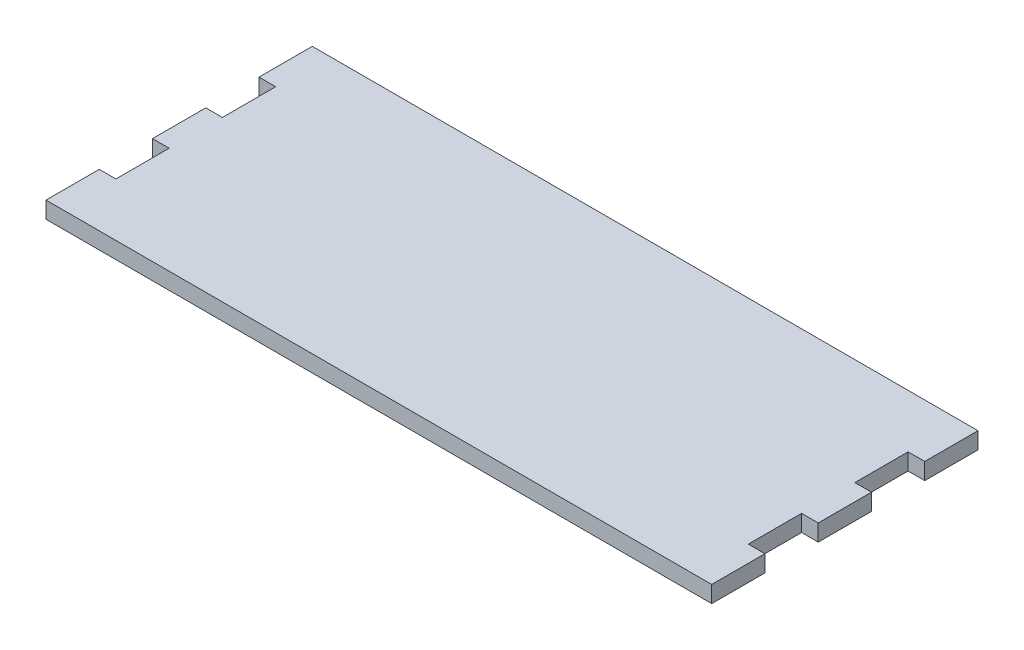
ISO-10303-21;
HEADER;
FILE_DESCRIPTION(('STEP AP214'),'2;1');
FILE_NAME('part.step','',(''),(''),'','','');
FILE_SCHEMA(('AUTOMOTIVE_DESIGN { 1 0 10303 214 1 1 1 1 }'));
ENDSEC;
DATA;
#1=APPLICATION_CONTEXT('core data for automotive mechanical design processes');
#2=APPLICATION_PROTOCOL_DEFINITION('international standard','automotive_design',2000,#1);
#3=PRODUCT_CONTEXT('',#1,'mechanical');
#4=PRODUCT('Part','Part','',(#3));
#5=PRODUCT_RELATED_PRODUCT_CATEGORY('part','',(#4));
#6=PRODUCT_DEFINITION_FORMATION('','',#4);
#7=PRODUCT_DEFINITION_CONTEXT('part definition',#1,'design');
#8=PRODUCT_DEFINITION('design','',#6,#7);
#9=PRODUCT_DEFINITION_SHAPE('','',#8);
#10=(LENGTH_UNIT() NAMED_UNIT(*) SI_UNIT(.MILLI.,.METRE.));
#11=(NAMED_UNIT(*) PLANE_ANGLE_UNIT() SI_UNIT($,.RADIAN.));
#12=(NAMED_UNIT(*) SI_UNIT($,.STERADIAN.) SOLID_ANGLE_UNIT());
#13=UNCERTAINTY_MEASURE_WITH_UNIT(LENGTH_MEASURE(1.E-05),#10,'distance_accuracy_value','');
#14=(GEOMETRIC_REPRESENTATION_CONTEXT(3) GLOBAL_UNCERTAINTY_ASSIGNED_CONTEXT((#13)) GLOBAL_UNIT_ASSIGNED_CONTEXT((#10,
#11,#12)) REPRESENTATION_CONTEXT('',''));
#15=CARTESIAN_POINT('',(0.,0.,0.));
#16=DIRECTION('',(0.,0.,1.));
#17=DIRECTION('',(1.,0.,0.));
#18=AXIS2_PLACEMENT_3D('',#15,#16,#17);
#19=CARTESIAN_POINT('',(100.,5.,24.));
#20=DIRECTION('',(-1.,0.,0.));
#21=DIRECTION('',(0.,0.,1.));
#22=AXIS2_PLACEMENT_3D('',#19,#20,#21);
#23=PLANE('',#22);
#24=DIRECTION('',(0.,0.,-1.));
#25=VECTOR('',#24,1.);
#26=CARTESIAN_POINT('',(100.,0.,24.));
#27=LINE('',#26,#25);
#28=CARTESIAN_POINT('',(100.,0.,40.));
#29=VERTEX_POINT('',#28);
#30=CARTESIAN_POINT('',(100.,0.,24.));
#31=VERTEX_POINT('',#30);
#32=EDGE_CURVE('E201',#29,#31,#27,.T.);
#33=ORIENTED_EDGE('',*,*,#32,.T.);
#34=DIRECTION('',(0.,-1.,0.));
#35=VECTOR('',#34,1.);
#36=CARTESIAN_POINT('',(100.,5.,24.));
#37=LINE('',#36,#35);
#38=CARTESIAN_POINT('',(100.,5.,24.));
#39=VERTEX_POINT('',#38);
#40=EDGE_CURVE('E11',#39,#31,#37,.T.);
#41=ORIENTED_EDGE('',*,*,#40,.F.);
#42=DIRECTION('',(0.,0.,-1.));
#43=VECTOR('',#42,1.);
#44=CARTESIAN_POINT('',(100.,5.,24.));
#45=LINE('',#44,#43);
#46=CARTESIAN_POINT('',(100.,5.,40.));
#47=VERTEX_POINT('',#46);
#48=EDGE_CURVE('E239',#47,#39,#45,.T.);
#49=ORIENTED_EDGE('',*,*,#48,.F.);
#50=DIRECTION('',(0.,-1.,0.));
#51=VECTOR('',#50,1.);
#52=CARTESIAN_POINT('',(100.,5.,40.));
#53=LINE('',#52,#51);
#54=EDGE_CURVE('E197',#47,#29,#53,.T.);
#55=ORIENTED_EDGE('',*,*,#54,.T.);
#56=EDGE_LOOP('',(#33,#41,#49,#55));
#57=FACE_BOUND('',#56,.T.);
#58=ADVANCED_FACE('F33',(#57),#23,.F.);
#59=CARTESIAN_POINT('',(95.,5.,24.));
#60=DIRECTION('',(0.,0.,1.));
#61=DIRECTION('',(1.,0.,0.));
#62=AXIS2_PLACEMENT_3D('',#59,#60,#61);
#63=PLANE('',#62);
#64=DIRECTION('',(-1.,0.,0.));
#65=VECTOR('',#64,1.);
#66=CARTESIAN_POINT('',(95.,0.,24.));
#67=LINE('',#66,#65);
#68=CARTESIAN_POINT('',(95.,0.,24.));
#69=VERTEX_POINT('',#68);
#70=EDGE_CURVE('E204',#31,#69,#67,.T.);
#71=ORIENTED_EDGE('',*,*,#70,.T.);
#72=DIRECTION('',(0.,-1.,0.));
#73=VECTOR('',#72,1.);
#74=CARTESIAN_POINT('',(95.,5.,24.));
#75=LINE('',#74,#73);
#76=CARTESIAN_POINT('',(95.,5.,24.));
#77=VERTEX_POINT('',#76);
#78=EDGE_CURVE('E41',#77,#69,#75,.T.);
#79=ORIENTED_EDGE('',*,*,#78,.F.);
#80=DIRECTION('',(-1.,0.,0.));
#81=VECTOR('',#80,1.);
#82=CARTESIAN_POINT('',(95.,5.,24.));
#83=LINE('',#82,#81);
#84=EDGE_CURVE('E128',#39,#77,#83,.T.);
#85=ORIENTED_EDGE('',*,*,#84,.F.);
#86=ORIENTED_EDGE('',*,*,#40,.T.);
#87=EDGE_LOOP('',(#71,#79,#85,#86));
#88=FACE_BOUND('',#87,.T.);
#89=ADVANCED_FACE('F357',(#88),#63,.F.);
#90=CARTESIAN_POINT('',(95.,5.,7.99999999999999));
#91=DIRECTION('',(-1.,0.,0.));
#92=DIRECTION('',(0.,0.,1.));
#93=AXIS2_PLACEMENT_3D('',#90,#91,#92);
#94=PLANE('',#93);
#95=DIRECTION('',(0.,0.,-1.));
#96=VECTOR('',#95,1.);
#97=CARTESIAN_POINT('',(95.,0.,7.99999999999999));
#98=LINE('',#97,#96);
#99=CARTESIAN_POINT('',(95.,0.,7.99999999999999));
#100=VERTEX_POINT('',#99);
#101=EDGE_CURVE('E206',#69,#100,#98,.T.);
#102=ORIENTED_EDGE('',*,*,#101,.T.);
#103=DIRECTION('',(0.,-1.,0.));
#104=VECTOR('',#103,1.);
#105=CARTESIAN_POINT('',(95.,5.,7.99999999999999));
#106=LINE('',#105,#104);
#107=CARTESIAN_POINT('',(95.,5.,7.99999999999999));
#108=VERTEX_POINT('',#107);
#109=EDGE_CURVE('E282',#108,#100,#106,.T.);
#110=ORIENTED_EDGE('',*,*,#109,.F.);
#111=DIRECTION('',(0.,0.,-1.));
#112=VECTOR('',#111,1.);
#113=CARTESIAN_POINT('',(95.,5.,7.99999999999999));
#114=LINE('',#113,#112);
#115=EDGE_CURVE('E290',#77,#108,#114,.T.);
#116=ORIENTED_EDGE('',*,*,#115,.F.);
#117=ORIENTED_EDGE('',*,*,#78,.T.);
#118=EDGE_LOOP('',(#102,#110,#116,#117));
#119=FACE_BOUND('',#118,.T.);
#120=ADVANCED_FACE('F288',(#119),#94,.F.);
#121=CARTESIAN_POINT('',(95.,5.,7.99999999999999));
#122=DIRECTION('',(0.,0.,-1.));
#123=DIRECTION('',(-1.,0.,0.));
#124=AXIS2_PLACEMENT_3D('',#121,#122,#123);
#125=PLANE('',#124);
#126=DIRECTION('',(1.,0.,0.));
#127=VECTOR('',#126,1.);
#128=CARTESIAN_POINT('',(95.,0.,7.99999999999999));
#129=LINE('',#128,#127);
#130=CARTESIAN_POINT('',(100.,0.,7.99999999999999));
#131=VERTEX_POINT('',#130);
#132=EDGE_CURVE('E208',#100,#131,#129,.T.);
#133=ORIENTED_EDGE('',*,*,#132,.T.);
#134=DIRECTION('',(0.,-1.,0.));
#135=VECTOR('',#134,1.);
#136=CARTESIAN_POINT('',(100.,5.,7.99999999999999));
#137=LINE('',#136,#135);
#138=CARTESIAN_POINT('',(100.,5.,7.99999999999999));
#139=VERTEX_POINT('',#138);
#140=EDGE_CURVE('E279',#139,#131,#137,.T.);
#141=ORIENTED_EDGE('',*,*,#140,.F.);
#142=DIRECTION('',(1.,0.,0.));
#143=VECTOR('',#142,1.);
#144=CARTESIAN_POINT('',(95.,5.,7.99999999999999));
#145=LINE('',#144,#143);
#146=EDGE_CURVE('E308',#108,#139,#145,.T.);
#147=ORIENTED_EDGE('',*,*,#146,.F.);
#148=ORIENTED_EDGE('',*,*,#109,.T.);
#149=EDGE_LOOP('',(#133,#141,#147,#148));
#150=FACE_BOUND('',#149,.T.);
#151=ADVANCED_FACE('F299',(#150),#125,.F.);
#152=CARTESIAN_POINT('',(100.,5.,-8.00000000000001));
#153=DIRECTION('',(-1.,0.,0.));
#154=DIRECTION('',(0.,0.,1.));
#155=AXIS2_PLACEMENT_3D('',#152,#153,#154);
#156=PLANE('',#155);
#157=DIRECTION('',(0.,0.,-1.));
#158=VECTOR('',#157,1.);
#159=CARTESIAN_POINT('',(100.,0.,-8.00000000000001));
#160=LINE('',#159,#158);
#161=CARTESIAN_POINT('',(100.,0.,-8.00000000000001));
#162=VERTEX_POINT('',#161);
#163=EDGE_CURVE('E210',#131,#162,#160,.T.);
#164=ORIENTED_EDGE('',*,*,#163,.T.);
#165=DIRECTION('',(0.,-1.,0.));
#166=VECTOR('',#165,1.);
#167=CARTESIAN_POINT('',(100.,5.,-8.00000000000001));
#168=LINE('',#167,#166);
#169=CARTESIAN_POINT('',(100.,5.,-8.00000000000001));
#170=VERTEX_POINT('',#169);
#171=EDGE_CURVE('E276',#170,#162,#168,.T.);
#172=ORIENTED_EDGE('',*,*,#171,.F.);
#173=DIRECTION('',(0.,0.,-1.));
#174=VECTOR('',#173,1.);
#175=CARTESIAN_POINT('',(100.,5.,-8.00000000000001));
#176=LINE('',#175,#174);
#177=EDGE_CURVE('E305',#139,#170,#176,.T.);
#178=ORIENTED_EDGE('',*,*,#177,.F.);
#179=ORIENTED_EDGE('',*,*,#140,.T.);
#180=EDGE_LOOP('',(#164,#172,#178,#179));
#181=FACE_BOUND('',#180,.T.);
#182=ADVANCED_FACE('F303',(#181),#156,.F.);
#183=CARTESIAN_POINT('',(95.,5.,-8.00000000000001));
#184=DIRECTION('',(0.,0.,1.));
#185=DIRECTION('',(1.,0.,0.));
#186=AXIS2_PLACEMENT_3D('',#183,#184,#185);
#187=PLANE('',#186);
#188=DIRECTION('',(-1.,0.,0.));
#189=VECTOR('',#188,1.);
#190=CARTESIAN_POINT('',(95.,0.,-8.00000000000001));
#191=LINE('',#190,#189);
#192=CARTESIAN_POINT('',(95.,0.,-8.00000000000001));
#193=VERTEX_POINT('',#192);
#194=EDGE_CURVE('E212',#162,#193,#191,.T.);
#195=ORIENTED_EDGE('',*,*,#194,.T.);
#196=DIRECTION('',(0.,-1.,0.));
#197=VECTOR('',#196,1.);
#198=CARTESIAN_POINT('',(95.,5.,-8.00000000000001));
#199=LINE('',#198,#197);
#200=CARTESIAN_POINT('',(95.,5.,-8.00000000000001));
#201=VERTEX_POINT('',#200);
#202=EDGE_CURVE('E273',#201,#193,#199,.T.);
#203=ORIENTED_EDGE('',*,*,#202,.F.);
#204=DIRECTION('',(-1.,0.,0.));
#205=VECTOR('',#204,1.);
#206=CARTESIAN_POINT('',(95.,5.,-8.00000000000001));
#207=LINE('',#206,#205);
#208=EDGE_CURVE('E307',#170,#201,#207,.T.);
#209=ORIENTED_EDGE('',*,*,#208,.F.);
#210=ORIENTED_EDGE('',*,*,#171,.T.);
#211=EDGE_LOOP('',(#195,#203,#209,#210));
#212=FACE_BOUND('',#211,.T.);
#213=ADVANCED_FACE('F370',(#212),#187,.F.);
#214=CARTESIAN_POINT('',(95.,5.,-24.));
#215=DIRECTION('',(-1.,0.,0.));
#216=DIRECTION('',(0.,0.,1.));
#217=AXIS2_PLACEMENT_3D('',#214,#215,#216);
#218=PLANE('',#217);
#219=DIRECTION('',(0.,0.,-1.));
#220=VECTOR('',#219,1.);
#221=CARTESIAN_POINT('',(95.,0.,-24.));
#222=LINE('',#221,#220);
#223=CARTESIAN_POINT('',(95.,0.,-24.));
#224=VERTEX_POINT('',#223);
#225=EDGE_CURVE('E214',#193,#224,#222,.T.);
#226=ORIENTED_EDGE('',*,*,#225,.T.);
#227=DIRECTION('',(0.,-1.,0.));
#228=VECTOR('',#227,1.);
#229=CARTESIAN_POINT('',(95.,5.,-24.));
#230=LINE('',#229,#228);
#231=CARTESIAN_POINT('',(95.,5.,-24.));
#232=VERTEX_POINT('',#231);
#233=EDGE_CURVE('E270',#232,#224,#230,.T.);
#234=ORIENTED_EDGE('',*,*,#233,.F.);
#235=DIRECTION('',(0.,0.,-1.));
#236=VECTOR('',#235,1.);
#237=CARTESIAN_POINT('',(95.,5.,-24.));
#238=LINE('',#237,#236);
#239=EDGE_CURVE('E310',#201,#232,#238,.T.);
#240=ORIENTED_EDGE('',*,*,#239,.F.);
#241=ORIENTED_EDGE('',*,*,#202,.T.);
#242=EDGE_LOOP('',(#226,#234,#240,#241));
#243=FACE_BOUND('',#242,.T.);
#244=ADVANCED_FACE('F373',(#243),#218,.F.);
#245=CARTESIAN_POINT('',(95.,5.,-24.));
#246=DIRECTION('',(0.,0.,-1.));
#247=DIRECTION('',(-1.,0.,0.));
#248=AXIS2_PLACEMENT_3D('',#245,#246,#247);
#249=PLANE('',#248);
#250=DIRECTION('',(1.,0.,0.));
#251=VECTOR('',#250,1.);
#252=CARTESIAN_POINT('',(95.,0.,-24.));
#253=LINE('',#252,#251);
#254=CARTESIAN_POINT('',(100.,0.,-24.));
#255=VERTEX_POINT('',#254);
#256=EDGE_CURVE('E216',#224,#255,#253,.T.);
#257=ORIENTED_EDGE('',*,*,#256,.T.);
#258=DIRECTION('',(0.,-1.,0.));
#259=VECTOR('',#258,1.);
#260=CARTESIAN_POINT('',(100.,5.,-24.));
#261=LINE('',#260,#259);
#262=CARTESIAN_POINT('',(100.,5.,-24.));
#263=VERTEX_POINT('',#262);
#264=EDGE_CURVE('E267',#263,#255,#261,.T.);
#265=ORIENTED_EDGE('',*,*,#264,.F.);
#266=DIRECTION('',(1.,0.,0.));
#267=VECTOR('',#266,1.);
#268=CARTESIAN_POINT('',(95.,5.,-24.));
#269=LINE('',#268,#267);
#270=EDGE_CURVE('E316',#232,#263,#269,.T.);
#271=ORIENTED_EDGE('',*,*,#270,.F.);
#272=ORIENTED_EDGE('',*,*,#233,.T.);
#273=EDGE_LOOP('',(#257,#265,#271,#272));
#274=FACE_BOUND('',#273,.T.);
#275=ADVANCED_FACE('F377',(#274),#249,.F.);
#276=CARTESIAN_POINT('',(100.,5.,-40.));
#277=DIRECTION('',(-1.,0.,0.));
#278=DIRECTION('',(0.,0.,1.));
#279=AXIS2_PLACEMENT_3D('',#276,#277,#278);
#280=PLANE('',#279);
#281=DIRECTION('',(0.,0.,-1.));
#282=VECTOR('',#281,1.);
#283=CARTESIAN_POINT('',(100.,0.,-40.));
#284=LINE('',#283,#282);
#285=CARTESIAN_POINT('',(100.,0.,-40.));
#286=VERTEX_POINT('',#285);
#287=EDGE_CURVE('E218',#255,#286,#284,.T.);
#288=ORIENTED_EDGE('',*,*,#287,.T.);
#289=DIRECTION('',(0.,-1.,0.));
#290=VECTOR('',#289,1.);
#291=CARTESIAN_POINT('',(100.,5.,-40.));
#292=LINE('',#291,#290);
#293=CARTESIAN_POINT('',(100.,5.,-40.));
#294=VERTEX_POINT('',#293);
#295=EDGE_CURVE('E264',#294,#286,#292,.T.);
#296=ORIENTED_EDGE('',*,*,#295,.F.);
#297=DIRECTION('',(0.,0.,-1.));
#298=VECTOR('',#297,1.);
#299=CARTESIAN_POINT('',(100.,5.,-40.));
#300=LINE('',#299,#298);
#301=EDGE_CURVE('E318',#263,#294,#300,.T.);
#302=ORIENTED_EDGE('',*,*,#301,.F.);
#303=ORIENTED_EDGE('',*,*,#264,.T.);
#304=EDGE_LOOP('',(#288,#296,#302,#303));
#305=FACE_BOUND('',#304,.T.);
#306=ADVANCED_FACE('F381',(#305),#280,.F.);
#307=CARTESIAN_POINT('',(-100.,5.,-40.));
#308=DIRECTION('',(0.,0.,1.));
#309=DIRECTION('',(1.,0.,0.));
#310=AXIS2_PLACEMENT_3D('',#307,#308,#309);
#311=PLANE('',#310);
#312=DIRECTION('',(-1.,0.,0.));
#313=VECTOR('',#312,1.);
#314=CARTESIAN_POINT('',(-100.,0.,-40.));
#315=LINE('',#314,#313);
#316=CARTESIAN_POINT('',(-100.,0.,-40.));
#317=VERTEX_POINT('',#316);
#318=EDGE_CURVE('E220',#286,#317,#315,.T.);
#319=ORIENTED_EDGE('',*,*,#318,.T.);
#320=DIRECTION('',(0.,-1.,0.));
#321=VECTOR('',#320,1.);
#322=CARTESIAN_POINT('',(-100.,5.,-40.));
#323=LINE('',#322,#321);
#324=CARTESIAN_POINT('',(-100.,5.,-40.));
#325=VERTEX_POINT('',#324);
#326=EDGE_CURVE('E261',#325,#317,#323,.T.);
#327=ORIENTED_EDGE('',*,*,#326,.F.);
#328=DIRECTION('',(-1.,0.,0.));
#329=VECTOR('',#328,1.);
#330=CARTESIAN_POINT('',(-100.,5.,-40.));
#331=LINE('',#330,#329);
#332=EDGE_CURVE('E320',#294,#325,#331,.T.);
#333=ORIENTED_EDGE('',*,*,#332,.F.);
#334=ORIENTED_EDGE('',*,*,#295,.T.);
#335=EDGE_LOOP('',(#319,#327,#333,#334));
#336=FACE_BOUND('',#335,.T.);
#337=ADVANCED_FACE('F385',(#336),#311,.F.);
#338=CARTESIAN_POINT('',(-100.,5.,-40.));
#339=DIRECTION('',(1.,0.,0.));
#340=DIRECTION('',(0.,0.,-1.));
#341=AXIS2_PLACEMENT_3D('',#338,#339,#340);
#342=PLANE('',#341);
#343=DIRECTION('',(0.,0.,1.));
#344=VECTOR('',#343,1.);
#345=CARTESIAN_POINT('',(-100.,0.,-40.));
#346=LINE('',#345,#344);
#347=CARTESIAN_POINT('',(-100.,0.,-24.));
#348=VERTEX_POINT('',#347);
#349=EDGE_CURVE('E222',#317,#348,#346,.T.);
#350=ORIENTED_EDGE('',*,*,#349,.T.);
#351=DIRECTION('',(0.,-1.,0.));
#352=VECTOR('',#351,1.);
#353=CARTESIAN_POINT('',(-100.,5.,-24.));
#354=LINE('',#353,#352);
#355=CARTESIAN_POINT('',(-100.,5.,-24.));
#356=VERTEX_POINT('',#355);
#357=EDGE_CURVE('E258',#356,#348,#354,.T.);
#358=ORIENTED_EDGE('',*,*,#357,.F.);
#359=DIRECTION('',(0.,0.,1.));
#360=VECTOR('',#359,1.);
#361=CARTESIAN_POINT('',(-100.,5.,-40.));
#362=LINE('',#361,#360);
#363=EDGE_CURVE('E322',#325,#356,#362,.T.);
#364=ORIENTED_EDGE('',*,*,#363,.F.);
#365=ORIENTED_EDGE('',*,*,#326,.T.);
#366=EDGE_LOOP('',(#350,#358,#364,#365));
#367=FACE_BOUND('',#366,.T.);
#368=ADVANCED_FACE('F389',(#367),#342,.F.);
#369=CARTESIAN_POINT('',(-100.,5.,-24.));
#370=DIRECTION('',(0.,0.,-1.));
#371=DIRECTION('',(-1.,0.,0.));
#372=AXIS2_PLACEMENT_3D('',#369,#370,#371);
#373=PLANE('',#372);
#374=DIRECTION('',(1.,0.,0.));
#375=VECTOR('',#374,1.);
#376=CARTESIAN_POINT('',(-100.,0.,-24.));
#377=LINE('',#376,#375);
#378=CARTESIAN_POINT('',(-95.,0.,-24.));
#379=VERTEX_POINT('',#378);
#380=EDGE_CURVE('E224',#348,#379,#377,.T.);
#381=ORIENTED_EDGE('',*,*,#380,.T.);
#382=DIRECTION('',(0.,-1.,0.));
#383=VECTOR('',#382,1.);
#384=CARTESIAN_POINT('',(-95.,5.,-24.));
#385=LINE('',#384,#383);
#386=CARTESIAN_POINT('',(-95.,5.,-24.));
#387=VERTEX_POINT('',#386);
#388=EDGE_CURVE('E255',#387,#379,#385,.T.);
#389=ORIENTED_EDGE('',*,*,#388,.F.);
#390=DIRECTION('',(1.,0.,0.));
#391=VECTOR('',#390,1.);
#392=CARTESIAN_POINT('',(-100.,5.,-24.));
#393=LINE('',#392,#391);
#394=EDGE_CURVE('E324',#356,#387,#393,.T.);
#395=ORIENTED_EDGE('',*,*,#394,.F.);
#396=ORIENTED_EDGE('',*,*,#357,.T.);
#397=EDGE_LOOP('',(#381,#389,#395,#396));
#398=FACE_BOUND('',#397,.T.);
#399=ADVANCED_FACE('F393',(#398),#373,.F.);
#400=CARTESIAN_POINT('',(-95.,5.,-24.));
#401=DIRECTION('',(1.,0.,0.));
#402=DIRECTION('',(0.,0.,-1.));
#403=AXIS2_PLACEMENT_3D('',#400,#401,#402);
#404=PLANE('',#403);
#405=DIRECTION('',(0.,0.,1.));
#406=VECTOR('',#405,1.);
#407=CARTESIAN_POINT('',(-95.,0.,-24.));
#408=LINE('',#407,#406);
#409=CARTESIAN_POINT('',(-95.,0.,-8.00000000000002));
#410=VERTEX_POINT('',#409);
#411=EDGE_CURVE('E226',#379,#410,#408,.T.);
#412=ORIENTED_EDGE('',*,*,#411,.T.);
#413=DIRECTION('',(0.,-1.,0.));
#414=VECTOR('',#413,1.);
#415=CARTESIAN_POINT('',(-95.,5.,-8.00000000000002));
#416=LINE('',#415,#414);
#417=CARTESIAN_POINT('',(-95.,5.,-8.00000000000002));
#418=VERTEX_POINT('',#417);
#419=EDGE_CURVE('E252',#418,#410,#416,.T.);
#420=ORIENTED_EDGE('',*,*,#419,.F.);
#421=DIRECTION('',(0.,0.,1.));
#422=VECTOR('',#421,1.);
#423=CARTESIAN_POINT('',(-95.,5.,-24.));
#424=LINE('',#423,#422);
#425=EDGE_CURVE('E326',#387,#418,#424,.T.);
#426=ORIENTED_EDGE('',*,*,#425,.F.);
#427=ORIENTED_EDGE('',*,*,#388,.T.);
#428=EDGE_LOOP('',(#412,#420,#426,#427));
#429=FACE_BOUND('',#428,.T.);
#430=ADVANCED_FACE('F397',(#429),#404,.F.);
#431=CARTESIAN_POINT('',(-100.,5.,-8.00000000000002));
#432=DIRECTION('',(0.,0.,1.));
#433=DIRECTION('',(1.,0.,0.));
#434=AXIS2_PLACEMENT_3D('',#431,#432,#433);
#435=PLANE('',#434);
#436=DIRECTION('',(-1.,0.,0.));
#437=VECTOR('',#436,1.);
#438=CARTESIAN_POINT('',(-100.,0.,-8.00000000000002));
#439=LINE('',#438,#437);
#440=CARTESIAN_POINT('',(-100.,0.,-8.00000000000002));
#441=VERTEX_POINT('',#440);
#442=EDGE_CURVE('E228',#410,#441,#439,.T.);
#443=ORIENTED_EDGE('',*,*,#442,.T.);
#444=DIRECTION('',(0.,-1.,0.));
#445=VECTOR('',#444,1.);
#446=CARTESIAN_POINT('',(-100.,5.,-8.00000000000002));
#447=LINE('',#446,#445);
#448=CARTESIAN_POINT('',(-100.,5.,-8.00000000000002));
#449=VERTEX_POINT('',#448);
#450=EDGE_CURVE('E249',#449,#441,#447,.T.);
#451=ORIENTED_EDGE('',*,*,#450,.F.);
#452=DIRECTION('',(-1.,0.,0.));
#453=VECTOR('',#452,1.);
#454=CARTESIAN_POINT('',(-100.,5.,-8.00000000000002));
#455=LINE('',#454,#453);
#456=EDGE_CURVE('E328',#418,#449,#455,.T.);
#457=ORIENTED_EDGE('',*,*,#456,.F.);
#458=ORIENTED_EDGE('',*,*,#419,.T.);
#459=EDGE_LOOP('',(#443,#451,#457,#458));
#460=FACE_BOUND('',#459,.T.);
#461=ADVANCED_FACE('F401',(#460),#435,.F.);
#462=CARTESIAN_POINT('',(-100.,5.,-8.00000000000002));
#463=DIRECTION('',(1.,0.,0.));
#464=DIRECTION('',(0.,0.,-1.));
#465=AXIS2_PLACEMENT_3D('',#462,#463,#464);
#466=PLANE('',#465);
#467=DIRECTION('',(0.,0.,1.));
#468=VECTOR('',#467,1.);
#469=CARTESIAN_POINT('',(-100.,0.,-8.00000000000002));
#470=LINE('',#469,#468);
#471=CARTESIAN_POINT('',(-100.,0.,7.99999999999999));
#472=VERTEX_POINT('',#471);
#473=EDGE_CURVE('E230',#441,#472,#470,.T.);
#474=ORIENTED_EDGE('',*,*,#473,.T.);
#475=DIRECTION('',(0.,-1.,0.));
#476=VECTOR('',#475,1.);
#477=CARTESIAN_POINT('',(-100.,5.,7.99999999999999));
#478=LINE('',#477,#476);
#479=CARTESIAN_POINT('',(-100.,5.,7.99999999999999));
#480=VERTEX_POINT('',#479);
#481=EDGE_CURVE('E246',#480,#472,#478,.T.);
#482=ORIENTED_EDGE('',*,*,#481,.F.);
#483=DIRECTION('',(0.,0.,1.));
#484=VECTOR('',#483,1.);
#485=CARTESIAN_POINT('',(-100.,5.,-8.00000000000002));
#486=LINE('',#485,#484);
#487=EDGE_CURVE('E330',#449,#480,#486,.T.);
#488=ORIENTED_EDGE('',*,*,#487,.F.);
#489=ORIENTED_EDGE('',*,*,#450,.T.);
#490=EDGE_LOOP('',(#474,#482,#488,#489));
#491=FACE_BOUND('',#490,.T.);
#492=ADVANCED_FACE('F405',(#491),#466,.F.);
#493=CARTESIAN_POINT('',(-100.,5.,7.99999999999999));
#494=DIRECTION('',(0.,0.,-1.));
#495=DIRECTION('',(-1.,0.,0.));
#496=AXIS2_PLACEMENT_3D('',#493,#494,#495);
#497=PLANE('',#496);
#498=DIRECTION('',(1.,0.,0.));
#499=VECTOR('',#498,1.);
#500=CARTESIAN_POINT('',(-100.,0.,7.99999999999999));
#501=LINE('',#500,#499);
#502=CARTESIAN_POINT('',(-95.,0.,7.99999999999999));
#503=VERTEX_POINT('',#502);
#504=EDGE_CURVE('E232',#472,#503,#501,.T.);
#505=ORIENTED_EDGE('',*,*,#504,.T.);
#506=DIRECTION('',(0.,-1.,0.));
#507=VECTOR('',#506,1.);
#508=CARTESIAN_POINT('',(-95.,5.,7.99999999999999));
#509=LINE('',#508,#507);
#510=CARTESIAN_POINT('',(-95.,5.,7.99999999999999));
#511=VERTEX_POINT('',#510);
#512=EDGE_CURVE('E243',#511,#503,#509,.T.);
#513=ORIENTED_EDGE('',*,*,#512,.F.);
#514=DIRECTION('',(1.,0.,0.));
#515=VECTOR('',#514,1.);
#516=CARTESIAN_POINT('',(-100.,5.,7.99999999999999));
#517=LINE('',#516,#515);
#518=EDGE_CURVE('E332',#480,#511,#517,.T.);
#519=ORIENTED_EDGE('',*,*,#518,.F.);
#520=ORIENTED_EDGE('',*,*,#481,.T.);
#521=EDGE_LOOP('',(#505,#513,#519,#520));
#522=FACE_BOUND('',#521,.T.);
#523=ADVANCED_FACE('F338',(#522),#497,.F.);
#524=CARTESIAN_POINT('',(-95.,5.,7.99999999999999));
#525=DIRECTION('',(1.,0.,0.));
#526=DIRECTION('',(0.,0.,-1.));
#527=AXIS2_PLACEMENT_3D('',#524,#525,#526);
#528=PLANE('',#527);
#529=DIRECTION('',(0.,0.,1.));
#530=VECTOR('',#529,1.);
#531=CARTESIAN_POINT('',(-95.,0.,7.99999999999999));
#532=LINE('',#531,#530);
#533=CARTESIAN_POINT('',(-95.,0.,24.));
#534=VERTEX_POINT('',#533);
#535=EDGE_CURVE('E234',#503,#534,#532,.T.);
#536=ORIENTED_EDGE('',*,*,#535,.T.);
#537=DIRECTION('',(0.,-1.,0.));
#538=VECTOR('',#537,1.);
#539=CARTESIAN_POINT('',(-95.,5.,24.));
#540=LINE('',#539,#538);
#541=CARTESIAN_POINT('',(-95.,5.,24.));
#542=VERTEX_POINT('',#541);
#543=EDGE_CURVE('E192',#542,#534,#540,.T.);
#544=ORIENTED_EDGE('',*,*,#543,.F.);
#545=DIRECTION('',(0.,0.,1.));
#546=VECTOR('',#545,1.);
#547=CARTESIAN_POINT('',(-95.,5.,7.99999999999999));
#548=LINE('',#547,#546);
#549=EDGE_CURVE('E183',#511,#542,#548,.T.);
#550=ORIENTED_EDGE('',*,*,#549,.F.);
#551=ORIENTED_EDGE('',*,*,#512,.T.);
#552=EDGE_LOOP('',(#536,#544,#550,#551));
#553=FACE_BOUND('',#552,.T.);
#554=ADVANCED_FACE('F342',(#553),#528,.F.);
#555=CARTESIAN_POINT('',(-100.,5.,24.));
#556=DIRECTION('',(0.,0.,1.));
#557=DIRECTION('',(1.,0.,0.));
#558=AXIS2_PLACEMENT_3D('',#555,#556,#557);
#559=PLANE('',#558);
#560=DIRECTION('',(-1.,0.,0.));
#561=VECTOR('',#560,1.);
#562=CARTESIAN_POINT('',(-100.,0.,24.));
#563=LINE('',#562,#561);
#564=CARTESIAN_POINT('',(-100.,0.,24.));
#565=VERTEX_POINT('',#564);
#566=EDGE_CURVE('E191',#534,#565,#563,.T.);
#567=ORIENTED_EDGE('',*,*,#566,.T.);
#568=DIRECTION('',(0.,-1.,0.));
#569=VECTOR('',#568,1.);
#570=CARTESIAN_POINT('',(-100.,5.,24.));
#571=LINE('',#570,#569);
#572=CARTESIAN_POINT('',(-100.,5.,24.));
#573=VERTEX_POINT('',#572);
#574=EDGE_CURVE('E188',#573,#565,#571,.T.);
#575=ORIENTED_EDGE('',*,*,#574,.F.);
#576=DIRECTION('',(-1.,0.,0.));
#577=VECTOR('',#576,1.);
#578=CARTESIAN_POINT('',(-100.,5.,24.));
#579=LINE('',#578,#577);
#580=EDGE_CURVE('E177',#542,#573,#579,.T.);
#581=ORIENTED_EDGE('',*,*,#580,.F.);
#582=ORIENTED_EDGE('',*,*,#543,.T.);
#583=EDGE_LOOP('',(#567,#575,#581,#582));
#584=FACE_BOUND('',#583,.T.);
#585=ADVANCED_FACE('F189',(#584),#559,.F.);
#586=CARTESIAN_POINT('',(-100.,5.,24.));
#587=DIRECTION('',(1.,0.,0.));
#588=DIRECTION('',(0.,0.,-1.));
#589=AXIS2_PLACEMENT_3D('',#586,#587,#588);
#590=PLANE('',#589);
#591=DIRECTION('',(0.,0.,1.));
#592=VECTOR('',#591,1.);
#593=CARTESIAN_POINT('',(-100.,0.,24.));
#594=LINE('',#593,#592);
#595=CARTESIAN_POINT('',(-100.,0.,40.));
#596=VERTEX_POINT('',#595);
#597=EDGE_CURVE('E114',#565,#596,#594,.T.);
#598=ORIENTED_EDGE('',*,*,#597,.T.);
#599=DIRECTION('',(0.,-1.,0.));
#600=VECTOR('',#599,1.);
#601=CARTESIAN_POINT('',(-100.,5.,40.));
#602=LINE('',#601,#600);
#603=CARTESIAN_POINT('',(-100.,5.,40.));
#604=VERTEX_POINT('',#603);
#605=EDGE_CURVE('E193',#604,#596,#602,.T.);
#606=ORIENTED_EDGE('',*,*,#605,.F.);
#607=DIRECTION('',(0.,0.,1.));
#608=VECTOR('',#607,1.);
#609=CARTESIAN_POINT('',(-100.,5.,24.));
#610=LINE('',#609,#608);
#611=EDGE_CURVE('E181',#573,#604,#610,.T.);
#612=ORIENTED_EDGE('',*,*,#611,.F.);
#613=ORIENTED_EDGE('',*,*,#574,.T.);
#614=EDGE_LOOP('',(#598,#606,#612,#613));
#615=FACE_BOUND('',#614,.T.);
#616=ADVANCED_FACE('F195',(#615),#590,.F.);
#617=CARTESIAN_POINT('',(-100.,5.,40.));
#618=DIRECTION('',(0.,0.,-1.));
#619=DIRECTION('',(-1.,0.,0.));
#620=AXIS2_PLACEMENT_3D('',#617,#618,#619);
#621=PLANE('',#620);
#622=DIRECTION('',(1.,0.,0.));
#623=VECTOR('',#622,1.);
#624=CARTESIAN_POINT('',(-100.,0.,40.));
#625=LINE('',#624,#623);
#626=EDGE_CURVE('E120',#596,#29,#625,.T.);
#627=ORIENTED_EDGE('',*,*,#626,.T.);
#628=ORIENTED_EDGE('',*,*,#54,.F.);
#629=DIRECTION('',(1.,0.,0.));
#630=VECTOR('',#629,1.);
#631=CARTESIAN_POINT('',(-100.,5.,40.));
#632=LINE('',#631,#630);
#633=EDGE_CURVE('E49',#604,#47,#632,.T.);
#634=ORIENTED_EDGE('',*,*,#633,.F.);
#635=ORIENTED_EDGE('',*,*,#605,.T.);
#636=EDGE_LOOP('',(#627,#628,#634,#635));
#637=FACE_BOUND('',#636,.T.);
#638=ADVANCED_FACE('F346',(#637),#621,.F.);
#639=CARTESIAN_POINT('',(0.,5.,0.));
#640=DIRECTION('',(0.,1.,0.));
#641=DIRECTION('',(0.,0.,1.));
#642=AXIS2_PLACEMENT_3D('',#639,#640,#641);
#643=PLANE('',#642);
#644=ORIENTED_EDGE('',*,*,#48,.T.);
#645=ORIENTED_EDGE('',*,*,#84,.T.);
#646=ORIENTED_EDGE('',*,*,#115,.T.);
#647=ORIENTED_EDGE('',*,*,#146,.T.);
#648=ORIENTED_EDGE('',*,*,#177,.T.);
#649=ORIENTED_EDGE('',*,*,#208,.T.);
#650=ORIENTED_EDGE('',*,*,#239,.T.);
#651=ORIENTED_EDGE('',*,*,#270,.T.);
#652=ORIENTED_EDGE('',*,*,#301,.T.);
#653=ORIENTED_EDGE('',*,*,#332,.T.);
#654=ORIENTED_EDGE('',*,*,#363,.T.);
#655=ORIENTED_EDGE('',*,*,#394,.T.);
#656=ORIENTED_EDGE('',*,*,#425,.T.);
#657=ORIENTED_EDGE('',*,*,#456,.T.);
#658=ORIENTED_EDGE('',*,*,#487,.T.);
#659=ORIENTED_EDGE('',*,*,#518,.T.);
#660=ORIENTED_EDGE('',*,*,#549,.T.);
#661=ORIENTED_EDGE('',*,*,#580,.T.);
#662=ORIENTED_EDGE('',*,*,#611,.T.);
#663=ORIENTED_EDGE('',*,*,#633,.T.);
#664=EDGE_LOOP('',(#644,#645,#646,#647,#648,#649,#650,#651,#652,#653,#654,#655,#656,#657,#658,
#659,#660,#661,#662,#663));
#665=FACE_BOUND('',#664,.T.);
#666=ADVANCED_FACE('F179',(#665),#643,.T.);
#667=CARTESIAN_POINT('',(0.,0.,0.));
#668=DIRECTION('',(0.,1.,0.));
#669=DIRECTION('',(0.,0.,1.));
#670=AXIS2_PLACEMENT_3D('',#667,#668,#669);
#671=PLANE('',#670);
#672=ORIENTED_EDGE('',*,*,#32,.F.);
#673=ORIENTED_EDGE('',*,*,#626,.F.);
#674=ORIENTED_EDGE('',*,*,#597,.F.);
#675=ORIENTED_EDGE('',*,*,#566,.F.);
#676=ORIENTED_EDGE('',*,*,#535,.F.);
#677=ORIENTED_EDGE('',*,*,#504,.F.);
#678=ORIENTED_EDGE('',*,*,#473,.F.);
#679=ORIENTED_EDGE('',*,*,#442,.F.);
#680=ORIENTED_EDGE('',*,*,#411,.F.);
#681=ORIENTED_EDGE('',*,*,#380,.F.);
#682=ORIENTED_EDGE('',*,*,#349,.F.);
#683=ORIENTED_EDGE('',*,*,#318,.F.);
#684=ORIENTED_EDGE('',*,*,#287,.F.);
#685=ORIENTED_EDGE('',*,*,#256,.F.);
#686=ORIENTED_EDGE('',*,*,#225,.F.);
#687=ORIENTED_EDGE('',*,*,#194,.F.);
#688=ORIENTED_EDGE('',*,*,#163,.F.);
#689=ORIENTED_EDGE('',*,*,#132,.F.);
#690=ORIENTED_EDGE('',*,*,#101,.F.);
#691=ORIENTED_EDGE('',*,*,#70,.F.);
#692=EDGE_LOOP('',(#672,#673,#674,#675,#676,#677,#678,#679,#680,#681,#682,#683,#684,#685,#686,
#687,#688,#689,#690,#691));
#693=FACE_BOUND('',#692,.T.);
#694=ADVANCED_FACE('F294',(#693),#671,.F.);
#695=CLOSED_SHELL('',(#58,#89,#120,#151,#182,#213,#244,#275,#306,#337,#368,#399,#430,#461,#492,
#523,#554,#585,#616,#638,#666,#694));
#696=MANIFOLD_SOLID_BREP('B2',#695);
#697=ADVANCED_BREP_SHAPE_REPRESENTATION('',(#18,#696),#14);
#698=SHAPE_DEFINITION_REPRESENTATION(#9,#697);
ENDSEC;
END-ISO-10303-21;
